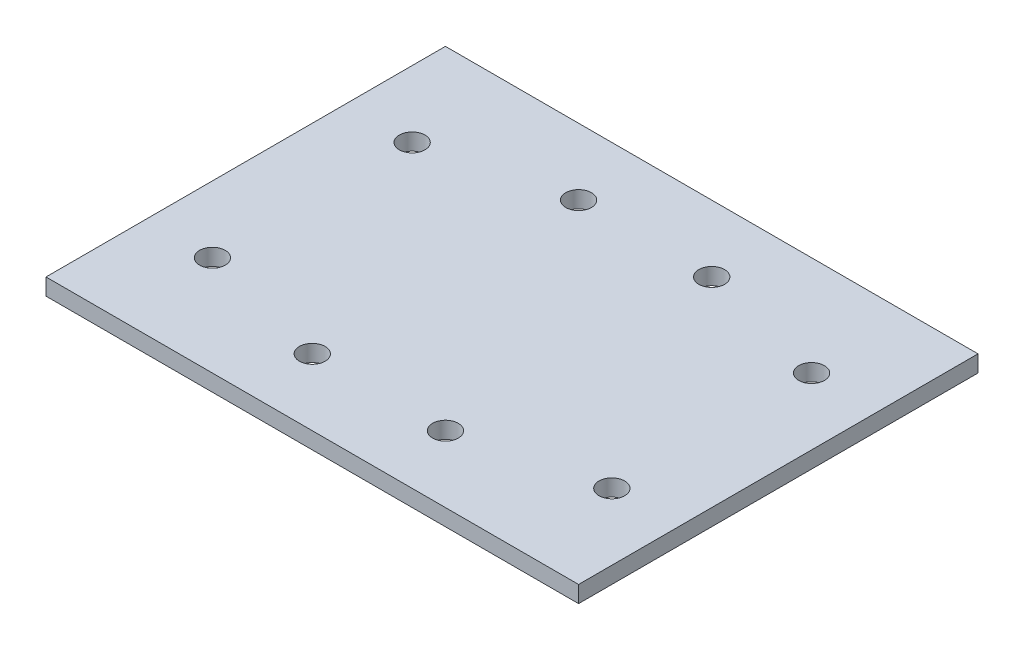
ISO-10303-21;
HEADER;
FILE_DESCRIPTION(('STEP AP214'),'2;1');
FILE_NAME('part.step','',(''),(''),'','','');
FILE_SCHEMA(('AUTOMOTIVE_DESIGN { 1 0 10303 214 1 1 1 1 }'));
ENDSEC;
DATA;
#1=APPLICATION_CONTEXT('core data for automotive mechanical design processes');
#2=APPLICATION_PROTOCOL_DEFINITION('international standard','automotive_design',2000,#1);
#3=PRODUCT_CONTEXT('',#1,'mechanical');
#4=PRODUCT('Part','Part','',(#3));
#5=PRODUCT_RELATED_PRODUCT_CATEGORY('part','',(#4));
#6=PRODUCT_DEFINITION_FORMATION('','',#4);
#7=PRODUCT_DEFINITION_CONTEXT('part definition',#1,'design');
#8=PRODUCT_DEFINITION('design','',#6,#7);
#9=PRODUCT_DEFINITION_SHAPE('','',#8);
#10=(LENGTH_UNIT() NAMED_UNIT(*) SI_UNIT(.MILLI.,.METRE.));
#11=(NAMED_UNIT(*) PLANE_ANGLE_UNIT() SI_UNIT($,.RADIAN.));
#12=(NAMED_UNIT(*) SI_UNIT($,.STERADIAN.) SOLID_ANGLE_UNIT());
#13=UNCERTAINTY_MEASURE_WITH_UNIT(LENGTH_MEASURE(1.E-05),#10,'distance_accuracy_value','');
#14=(GEOMETRIC_REPRESENTATION_CONTEXT(3) GLOBAL_UNCERTAINTY_ASSIGNED_CONTEXT((#13)) GLOBAL_UNIT_ASSIGNED_CONTEXT((#10,
#11,#12)) REPRESENTATION_CONTEXT('',''));
#15=CARTESIAN_POINT('',(0.,0.,0.));
#16=DIRECTION('',(0.,0.,1.));
#17=DIRECTION('',(1.,0.,0.));
#18=AXIS2_PLACEMENT_3D('',#15,#16,#17);
#19=CARTESIAN_POINT('',(101.6,6.35,76.2));
#20=DIRECTION('',(-1.,0.,0.));
#21=DIRECTION('',(0.,0.,1.));
#22=AXIS2_PLACEMENT_3D('',#19,#20,#21);
#23=PLANE('',#22);
#24=DIRECTION('',(0.,0.,-1.));
#25=VECTOR('',#24,1.);
#26=CARTESIAN_POINT('',(101.6,0.,76.2));
#27=LINE('',#26,#25);
#28=CARTESIAN_POINT('',(101.6,0.,76.2));
#29=VERTEX_POINT('',#28);
#30=CARTESIAN_POINT('',(101.6,0.,-76.2));
#31=VERTEX_POINT('',#30);
#32=EDGE_CURVE('E95',#29,#31,#27,.T.);
#33=ORIENTED_EDGE('',*,*,#32,.T.);
#34=DIRECTION('',(0.,-1.,0.));
#35=VECTOR('',#34,1.);
#36=CARTESIAN_POINT('',(101.6,6.35,-76.2));
#37=LINE('',#36,#35);
#38=CARTESIAN_POINT('',(101.6,6.35,-76.2));
#39=VERTEX_POINT('',#38);
#40=EDGE_CURVE('E11',#39,#31,#37,.T.);
#41=ORIENTED_EDGE('',*,*,#40,.F.);
#42=DIRECTION('',(0.,0.,-1.));
#43=VECTOR('',#42,1.);
#44=CARTESIAN_POINT('',(101.6,6.35,76.2));
#45=LINE('',#44,#43);
#46=CARTESIAN_POINT('',(101.6,6.35,76.2));
#47=VERTEX_POINT('',#46);
#48=EDGE_CURVE('E83',#47,#39,#45,.T.);
#49=ORIENTED_EDGE('',*,*,#48,.F.);
#50=DIRECTION('',(0.,-1.,0.));
#51=VECTOR('',#50,1.);
#52=CARTESIAN_POINT('',(101.6,6.35,76.2));
#53=LINE('',#52,#51);
#54=EDGE_CURVE('E91',#47,#29,#53,.T.);
#55=ORIENTED_EDGE('',*,*,#54,.T.);
#56=EDGE_LOOP('',(#33,#41,#49,#55));
#57=FACE_BOUND('',#56,.T.);
#58=ADVANCED_FACE('F32',(#57),#23,.F.);
#59=CARTESIAN_POINT('',(-101.6,6.35,-76.2));
#60=DIRECTION('',(0.,0.,1.));
#61=DIRECTION('',(1.,0.,0.));
#62=AXIS2_PLACEMENT_3D('',#59,#60,#61);
#63=PLANE('',#62);
#64=DIRECTION('',(-1.,0.,0.));
#65=VECTOR('',#64,1.);
#66=CARTESIAN_POINT('',(-101.6,0.,-76.2));
#67=LINE('',#66,#65);
#68=CARTESIAN_POINT('',(-101.6,0.,-76.2));
#69=VERTEX_POINT('',#68);
#70=EDGE_CURVE('E87',#31,#69,#67,.T.);
#71=ORIENTED_EDGE('',*,*,#70,.T.);
#72=DIRECTION('',(0.,-1.,0.));
#73=VECTOR('',#72,1.);
#74=CARTESIAN_POINT('',(-101.6,6.35,-76.2));
#75=LINE('',#74,#73);
#76=CARTESIAN_POINT('',(-101.6,6.35,-76.2));
#77=VERTEX_POINT('',#76);
#78=EDGE_CURVE('E40',#77,#69,#75,.T.);
#79=ORIENTED_EDGE('',*,*,#78,.F.);
#80=DIRECTION('',(-1.,0.,0.));
#81=VECTOR('',#80,1.);
#82=CARTESIAN_POINT('',(-101.6,6.35,-76.2));
#83=LINE('',#82,#81);
#84=EDGE_CURVE('E78',#39,#77,#83,.T.);
#85=ORIENTED_EDGE('',*,*,#84,.F.);
#86=ORIENTED_EDGE('',*,*,#40,.T.);
#87=EDGE_LOOP('',(#71,#79,#85,#86));
#88=FACE_BOUND('',#87,.T.);
#89=ADVANCED_FACE('F86',(#88),#63,.F.);
#90=CARTESIAN_POINT('',(-101.6,6.35,76.2));
#91=DIRECTION('',(1.,0.,0.));
#92=DIRECTION('',(0.,0.,-1.));
#93=AXIS2_PLACEMENT_3D('',#90,#91,#92);
#94=PLANE('',#93);
#95=DIRECTION('',(0.,0.,1.));
#96=VECTOR('',#95,1.);
#97=CARTESIAN_POINT('',(-101.6,0.,76.2));
#98=LINE('',#97,#96);
#99=CARTESIAN_POINT('',(-101.6,0.,76.2));
#100=VERTEX_POINT('',#99);
#101=EDGE_CURVE('E65',#69,#100,#98,.T.);
#102=ORIENTED_EDGE('',*,*,#101,.T.);
#103=DIRECTION('',(0.,-1.,0.));
#104=VECTOR('',#103,1.);
#105=CARTESIAN_POINT('',(-101.6,6.35,76.2));
#106=LINE('',#105,#104);
#107=CARTESIAN_POINT('',(-101.6,6.35,76.2));
#108=VERTEX_POINT('',#107);
#109=EDGE_CURVE('E88',#108,#100,#106,.T.);
#110=ORIENTED_EDGE('',*,*,#109,.F.);
#111=DIRECTION('',(0.,0.,1.));
#112=VECTOR('',#111,1.);
#113=CARTESIAN_POINT('',(-101.6,6.35,76.2));
#114=LINE('',#113,#112);
#115=EDGE_CURVE('E81',#77,#108,#114,.T.);
#116=ORIENTED_EDGE('',*,*,#115,.F.);
#117=ORIENTED_EDGE('',*,*,#78,.T.);
#118=EDGE_LOOP('',(#102,#110,#116,#117));
#119=FACE_BOUND('',#118,.T.);
#120=ADVANCED_FACE('F89',(#119),#94,.F.);
#121=CARTESIAN_POINT('',(-101.6,6.35,76.2));
#122=DIRECTION('',(0.,0.,-1.));
#123=DIRECTION('',(-1.,0.,0.));
#124=AXIS2_PLACEMENT_3D('',#121,#122,#123);
#125=PLANE('',#124);
#126=DIRECTION('',(1.,0.,0.));
#127=VECTOR('',#126,1.);
#128=CARTESIAN_POINT('',(-101.6,0.,76.2));
#129=LINE('',#128,#127);
#130=EDGE_CURVE('E71',#100,#29,#129,.T.);
#131=ORIENTED_EDGE('',*,*,#130,.T.);
#132=ORIENTED_EDGE('',*,*,#54,.F.);
#133=DIRECTION('',(1.,0.,0.));
#134=VECTOR('',#133,1.);
#135=CARTESIAN_POINT('',(-101.6,6.35,76.2));
#136=LINE('',#135,#134);
#137=EDGE_CURVE('E48',#108,#47,#136,.T.);
#138=ORIENTED_EDGE('',*,*,#137,.F.);
#139=ORIENTED_EDGE('',*,*,#109,.T.);
#140=EDGE_LOOP('',(#131,#132,#138,#139));
#141=FACE_BOUND('',#140,.T.);
#142=ADVANCED_FACE('F103',(#141),#125,.F.);
#143=CARTESIAN_POINT('',(0.,6.35,0.));
#144=DIRECTION('',(0.,-1.,0.));
#145=DIRECTION('',(0.,0.,-1.));
#146=AXIS2_PLACEMENT_3D('',#143,#144,#145);
#147=PLANE('',#146);
#148=CARTESIAN_POINT('',(-76.2,6.35,-38.1));
#149=DIRECTION('',(0.,1.,0.));
#150=DIRECTION('',(0.,0.,1.));
#151=AXIS2_PLACEMENT_3D('',#148,#149,#150);
#152=CIRCLE('',#151,4.9022);
#153=CARTESIAN_POINT('',(-76.2,6.35,-33.1978));
#154=VERTEX_POINT('',#153);
#155=EDGE_CURVE('E153',#154,#154,#152,.T.);
#156=ORIENTED_EDGE('',*,*,#155,.F.);
#157=EDGE_LOOP('',(#156));
#158=FACE_BOUND('',#157,.T.);
#159=CARTESIAN_POINT('',(76.2,6.35,-38.1));
#160=DIRECTION('',(0.,1.,0.));
#161=DIRECTION('',(0.,0.,1.));
#162=AXIS2_PLACEMENT_3D('',#159,#160,#161);
#163=CIRCLE('',#162,4.9022);
#164=CARTESIAN_POINT('',(76.2,6.35,-33.1978));
#165=VERTEX_POINT('',#164);
#166=EDGE_CURVE('E147',#165,#165,#163,.T.);
#167=ORIENTED_EDGE('',*,*,#166,.F.);
#168=EDGE_LOOP('',(#167));
#169=FACE_BOUND('',#168,.T.);
#170=CARTESIAN_POINT('',(76.2,6.35,38.1));
#171=DIRECTION('',(0.,1.,0.));
#172=DIRECTION('',(0.,0.,1.));
#173=AXIS2_PLACEMENT_3D('',#170,#171,#172);
#174=CIRCLE('',#173,4.9022);
#175=CARTESIAN_POINT('',(76.2,6.35,43.0022));
#176=VERTEX_POINT('',#175);
#177=EDGE_CURVE('E141',#176,#176,#174,.T.);
#178=ORIENTED_EDGE('',*,*,#177,.F.);
#179=EDGE_LOOP('',(#178));
#180=FACE_BOUND('',#179,.T.);
#181=CARTESIAN_POINT('',(-76.2,6.35,38.1));
#182=DIRECTION('',(0.,1.,0.));
#183=DIRECTION('',(0.,0.,1.));
#184=AXIS2_PLACEMENT_3D('',#181,#182,#183);
#185=CIRCLE('',#184,4.9022);
#186=CARTESIAN_POINT('',(-76.2,6.35,43.0022));
#187=VERTEX_POINT('',#186);
#188=EDGE_CURVE('E135',#187,#187,#185,.T.);
#189=ORIENTED_EDGE('',*,*,#188,.F.);
#190=EDGE_LOOP('',(#189));
#191=FACE_BOUND('',#190,.T.);
#192=CARTESIAN_POINT('',(-25.4,6.35,-50.8));
#193=DIRECTION('',(0.,1.,0.));
#194=DIRECTION('',(0.,0.,1.));
#195=AXIS2_PLACEMENT_3D('',#192,#193,#194);
#196=CIRCLE('',#195,4.9022);
#197=CARTESIAN_POINT('',(-25.4,6.35,-45.8978));
#198=VERTEX_POINT('',#197);
#199=EDGE_CURVE('E129',#198,#198,#196,.T.);
#200=ORIENTED_EDGE('',*,*,#199,.F.);
#201=EDGE_LOOP('',(#200));
#202=FACE_BOUND('',#201,.T.);
#203=CARTESIAN_POINT('',(25.4,6.35,-50.8));
#204=DIRECTION('',(0.,1.,0.));
#205=DIRECTION('',(0.,0.,1.));
#206=AXIS2_PLACEMENT_3D('',#203,#204,#205);
#207=CIRCLE('',#206,4.9022);
#208=CARTESIAN_POINT('',(25.4,6.35,-45.8978));
#209=VERTEX_POINT('',#208);
#210=EDGE_CURVE('E123',#209,#209,#207,.T.);
#211=ORIENTED_EDGE('',*,*,#210,.F.);
#212=EDGE_LOOP('',(#211));
#213=FACE_BOUND('',#212,.T.);
#214=CARTESIAN_POINT('',(-25.4,6.35,50.8));
#215=DIRECTION('',(0.,1.,0.));
#216=DIRECTION('',(0.,0.,1.));
#217=AXIS2_PLACEMENT_3D('',#214,#215,#216);
#218=CIRCLE('',#217,4.9022);
#219=CARTESIAN_POINT('',(-25.4,6.35,55.7022));
#220=VERTEX_POINT('',#219);
#221=EDGE_CURVE('E117',#220,#220,#218,.T.);
#222=ORIENTED_EDGE('',*,*,#221,.F.);
#223=EDGE_LOOP('',(#222));
#224=FACE_BOUND('',#223,.T.);
#225=CARTESIAN_POINT('',(25.4,6.35,50.8));
#226=DIRECTION('',(0.,1.,0.));
#227=DIRECTION('',(0.,0.,1.));
#228=AXIS2_PLACEMENT_3D('',#225,#226,#227);
#229=CIRCLE('',#228,4.9022);
#230=CARTESIAN_POINT('',(25.4,6.35,55.7022));
#231=VERTEX_POINT('',#230);
#232=EDGE_CURVE('E111',#231,#231,#229,.T.);
#233=ORIENTED_EDGE('',*,*,#232,.F.);
#234=EDGE_LOOP('',(#233));
#235=FACE_BOUND('',#234,.T.);
#236=ORIENTED_EDGE('',*,*,#48,.T.);
#237=ORIENTED_EDGE('',*,*,#84,.T.);
#238=ORIENTED_EDGE('',*,*,#115,.T.);
#239=ORIENTED_EDGE('',*,*,#137,.T.);
#240=EDGE_LOOP('',(#236,#237,#238,#239));
#241=FACE_BOUND('',#240,.T.);
#242=ADVANCED_FACE('F79',(#158,#169,#180,#191,#202,#213,#224,#235,#241),#147,.F.);
#243=CARTESIAN_POINT('',(0.,0.,0.));
#244=DIRECTION('',(0.,-1.,0.));
#245=DIRECTION('',(0.,0.,-1.));
#246=AXIS2_PLACEMENT_3D('',#243,#244,#245);
#247=PLANE('',#246);
#248=CARTESIAN_POINT('',(-76.2,0.,-38.1));
#249=DIRECTION('',(0.,1.,0.));
#250=DIRECTION('',(0.,0.,1.));
#251=AXIS2_PLACEMENT_3D('',#248,#249,#250);
#252=CIRCLE('',#251,4.9022);
#253=CARTESIAN_POINT('',(-76.2,0.,-33.1978));
#254=VERTEX_POINT('',#253);
#255=EDGE_CURVE('E150',#254,#254,#252,.T.);
#256=ORIENTED_EDGE('',*,*,#255,.T.);
#257=EDGE_LOOP('',(#256));
#258=FACE_BOUND('',#257,.T.);
#259=CARTESIAN_POINT('',(76.2,0.,-38.1));
#260=DIRECTION('',(0.,1.,0.));
#261=DIRECTION('',(0.,0.,1.));
#262=AXIS2_PLACEMENT_3D('',#259,#260,#261);
#263=CIRCLE('',#262,4.9022);
#264=CARTESIAN_POINT('',(76.2,0.,-33.1978));
#265=VERTEX_POINT('',#264);
#266=EDGE_CURVE('E144',#265,#265,#263,.T.);
#267=ORIENTED_EDGE('',*,*,#266,.T.);
#268=EDGE_LOOP('',(#267));
#269=FACE_BOUND('',#268,.T.);
#270=CARTESIAN_POINT('',(76.2,0.,38.1));
#271=DIRECTION('',(0.,1.,0.));
#272=DIRECTION('',(0.,0.,1.));
#273=AXIS2_PLACEMENT_3D('',#270,#271,#272);
#274=CIRCLE('',#273,4.9022);
#275=CARTESIAN_POINT('',(76.2,0.,43.0022));
#276=VERTEX_POINT('',#275);
#277=EDGE_CURVE('E138',#276,#276,#274,.T.);
#278=ORIENTED_EDGE('',*,*,#277,.T.);
#279=EDGE_LOOP('',(#278));
#280=FACE_BOUND('',#279,.T.);
#281=CARTESIAN_POINT('',(-76.2,0.,38.1));
#282=DIRECTION('',(0.,1.,0.));
#283=DIRECTION('',(0.,0.,1.));
#284=AXIS2_PLACEMENT_3D('',#281,#282,#283);
#285=CIRCLE('',#284,4.9022);
#286=CARTESIAN_POINT('',(-76.2,0.,43.0022));
#287=VERTEX_POINT('',#286);
#288=EDGE_CURVE('E132',#287,#287,#285,.T.);
#289=ORIENTED_EDGE('',*,*,#288,.T.);
#290=EDGE_LOOP('',(#289));
#291=FACE_BOUND('',#290,.T.);
#292=CARTESIAN_POINT('',(-25.4,0.,-50.8));
#293=DIRECTION('',(0.,1.,0.));
#294=DIRECTION('',(0.,0.,1.));
#295=AXIS2_PLACEMENT_3D('',#292,#293,#294);
#296=CIRCLE('',#295,4.9022);
#297=CARTESIAN_POINT('',(-25.4,0.,-45.8978));
#298=VERTEX_POINT('',#297);
#299=EDGE_CURVE('E126',#298,#298,#296,.T.);
#300=ORIENTED_EDGE('',*,*,#299,.T.);
#301=EDGE_LOOP('',(#300));
#302=FACE_BOUND('',#301,.T.);
#303=CARTESIAN_POINT('',(25.4,0.,-50.8));
#304=DIRECTION('',(0.,1.,0.));
#305=DIRECTION('',(0.,0.,1.));
#306=AXIS2_PLACEMENT_3D('',#303,#304,#305);
#307=CIRCLE('',#306,4.9022);
#308=CARTESIAN_POINT('',(25.4,0.,-45.8978));
#309=VERTEX_POINT('',#308);
#310=EDGE_CURVE('E120',#309,#309,#307,.T.);
#311=ORIENTED_EDGE('',*,*,#310,.T.);
#312=EDGE_LOOP('',(#311));
#313=FACE_BOUND('',#312,.T.);
#314=CARTESIAN_POINT('',(-25.4,0.,50.8));
#315=DIRECTION('',(0.,1.,0.));
#316=DIRECTION('',(0.,0.,1.));
#317=AXIS2_PLACEMENT_3D('',#314,#315,#316);
#318=CIRCLE('',#317,4.9022);
#319=CARTESIAN_POINT('',(-25.4,0.,55.7022));
#320=VERTEX_POINT('',#319);
#321=EDGE_CURVE('E114',#320,#320,#318,.T.);
#322=ORIENTED_EDGE('',*,*,#321,.T.);
#323=EDGE_LOOP('',(#322));
#324=FACE_BOUND('',#323,.T.);
#325=CARTESIAN_POINT('',(25.4,0.,50.8));
#326=DIRECTION('',(0.,1.,0.));
#327=DIRECTION('',(0.,0.,1.));
#328=AXIS2_PLACEMENT_3D('',#325,#326,#327);
#329=CIRCLE('',#328,4.9022);
#330=CARTESIAN_POINT('',(25.4,0.,55.7022));
#331=VERTEX_POINT('',#330);
#332=EDGE_CURVE('E98',#331,#331,#329,.T.);
#333=ORIENTED_EDGE('',*,*,#332,.T.);
#334=EDGE_LOOP('',(#333));
#335=FACE_BOUND('',#334,.T.);
#336=ORIENTED_EDGE('',*,*,#32,.F.);
#337=ORIENTED_EDGE('',*,*,#130,.F.);
#338=ORIENTED_EDGE('',*,*,#101,.F.);
#339=ORIENTED_EDGE('',*,*,#70,.F.);
#340=EDGE_LOOP('',(#336,#337,#338,#339));
#341=FACE_BOUND('',#340,.T.);
#342=ADVANCED_FACE('F106',(#258,#269,#280,#291,#302,#313,#324,#335,#341),#247,.T.);
#343=CARTESIAN_POINT('',(25.4,6.35,50.8));
#344=DIRECTION('',(0.,1.,0.));
#345=DIRECTION('',(0.,0.,1.));
#346=AXIS2_PLACEMENT_3D('',#343,#344,#345);
#347=CYLINDRICAL_SURFACE('',#346,4.9022);
#348=ORIENTED_EDGE('',*,*,#332,.F.);
#349=EDGE_LOOP('',(#348));
#350=FACE_BOUND('',#349,.T.);
#351=ORIENTED_EDGE('',*,*,#232,.T.);
#352=EDGE_LOOP('',(#351));
#353=FACE_BOUND('',#352,.T.);
#354=ADVANCED_FACE('F176',(#350,#353),#347,.F.);
#355=CARTESIAN_POINT('',(-25.4,6.35,50.8));
#356=DIRECTION('',(0.,1.,0.));
#357=DIRECTION('',(0.,0.,1.));
#358=AXIS2_PLACEMENT_3D('',#355,#356,#357);
#359=CYLINDRICAL_SURFACE('',#358,4.9022);
#360=ORIENTED_EDGE('',*,*,#321,.F.);
#361=EDGE_LOOP('',(#360));
#362=FACE_BOUND('',#361,.T.);
#363=ORIENTED_EDGE('',*,*,#221,.T.);
#364=EDGE_LOOP('',(#363));
#365=FACE_BOUND('',#364,.T.);
#366=ADVANCED_FACE('F178',(#362,#365),#359,.F.);
#367=CARTESIAN_POINT('',(25.4,6.35,-50.8));
#368=DIRECTION('',(0.,1.,0.));
#369=DIRECTION('',(0.,0.,1.));
#370=AXIS2_PLACEMENT_3D('',#367,#368,#369);
#371=CYLINDRICAL_SURFACE('',#370,4.9022);
#372=ORIENTED_EDGE('',*,*,#310,.F.);
#373=EDGE_LOOP('',(#372));
#374=FACE_BOUND('',#373,.T.);
#375=ORIENTED_EDGE('',*,*,#210,.T.);
#376=EDGE_LOOP('',(#375));
#377=FACE_BOUND('',#376,.T.);
#378=ADVANCED_FACE('F185',(#374,#377),#371,.F.);
#379=CARTESIAN_POINT('',(-25.4,6.35,-50.8));
#380=DIRECTION('',(0.,1.,0.));
#381=DIRECTION('',(0.,0.,1.));
#382=AXIS2_PLACEMENT_3D('',#379,#380,#381);
#383=CYLINDRICAL_SURFACE('',#382,4.9022);
#384=ORIENTED_EDGE('',*,*,#299,.F.);
#385=EDGE_LOOP('',(#384));
#386=FACE_BOUND('',#385,.T.);
#387=ORIENTED_EDGE('',*,*,#199,.T.);
#388=EDGE_LOOP('',(#387));
#389=FACE_BOUND('',#388,.T.);
#390=ADVANCED_FACE('F232',(#386,#389),#383,.F.);
#391=CARTESIAN_POINT('',(-76.2,6.35,38.1));
#392=DIRECTION('',(0.,1.,0.));
#393=DIRECTION('',(0.,0.,1.));
#394=AXIS2_PLACEMENT_3D('',#391,#392,#393);
#395=CYLINDRICAL_SURFACE('',#394,4.9022);
#396=ORIENTED_EDGE('',*,*,#288,.F.);
#397=EDGE_LOOP('',(#396));
#398=FACE_BOUND('',#397,.T.);
#399=ORIENTED_EDGE('',*,*,#188,.T.);
#400=EDGE_LOOP('',(#399));
#401=FACE_BOUND('',#400,.T.);
#402=ADVANCED_FACE('F242',(#398,#401),#395,.F.);
#403=CARTESIAN_POINT('',(76.2,6.35,38.1));
#404=DIRECTION('',(0.,1.,0.));
#405=DIRECTION('',(0.,0.,1.));
#406=AXIS2_PLACEMENT_3D('',#403,#404,#405);
#407=CYLINDRICAL_SURFACE('',#406,4.9022);
#408=ORIENTED_EDGE('',*,*,#277,.F.);
#409=EDGE_LOOP('',(#408));
#410=FACE_BOUND('',#409,.T.);
#411=ORIENTED_EDGE('',*,*,#177,.T.);
#412=EDGE_LOOP('',(#411));
#413=FACE_BOUND('',#412,.T.);
#414=ADVANCED_FACE('F252',(#410,#413),#407,.F.);
#415=CARTESIAN_POINT('',(76.2,6.35,-38.1));
#416=DIRECTION('',(0.,1.,0.));
#417=DIRECTION('',(0.,0.,1.));
#418=AXIS2_PLACEMENT_3D('',#415,#416,#417);
#419=CYLINDRICAL_SURFACE('',#418,4.9022);
#420=ORIENTED_EDGE('',*,*,#266,.F.);
#421=EDGE_LOOP('',(#420));
#422=FACE_BOUND('',#421,.T.);
#423=ORIENTED_EDGE('',*,*,#166,.T.);
#424=EDGE_LOOP('',(#423));
#425=FACE_BOUND('',#424,.T.);
#426=ADVANCED_FACE('F262',(#422,#425),#419,.F.);
#427=CARTESIAN_POINT('',(-76.2,6.35,-38.1));
#428=DIRECTION('',(0.,1.,0.));
#429=DIRECTION('',(0.,0.,1.));
#430=AXIS2_PLACEMENT_3D('',#427,#428,#429);
#431=CYLINDRICAL_SURFACE('',#430,4.9022);
#432=ORIENTED_EDGE('',*,*,#255,.F.);
#433=EDGE_LOOP('',(#432));
#434=FACE_BOUND('',#433,.T.);
#435=ORIENTED_EDGE('',*,*,#155,.T.);
#436=EDGE_LOOP('',(#435));
#437=FACE_BOUND('',#436,.T.);
#438=ADVANCED_FACE('F157',(#434,#437),#431,.F.);
#439=CLOSED_SHELL('',(#58,#89,#120,#142,#242,#342,#354,#366,#378,#390,#402,#414,#426,#438));
#440=MANIFOLD_SOLID_BREP('B2',#439);
#441=ADVANCED_BREP_SHAPE_REPRESENTATION('',(#18,#440),#14);
#442=SHAPE_DEFINITION_REPRESENTATION(#9,#441);
ENDSEC;
END-ISO-10303-21;
